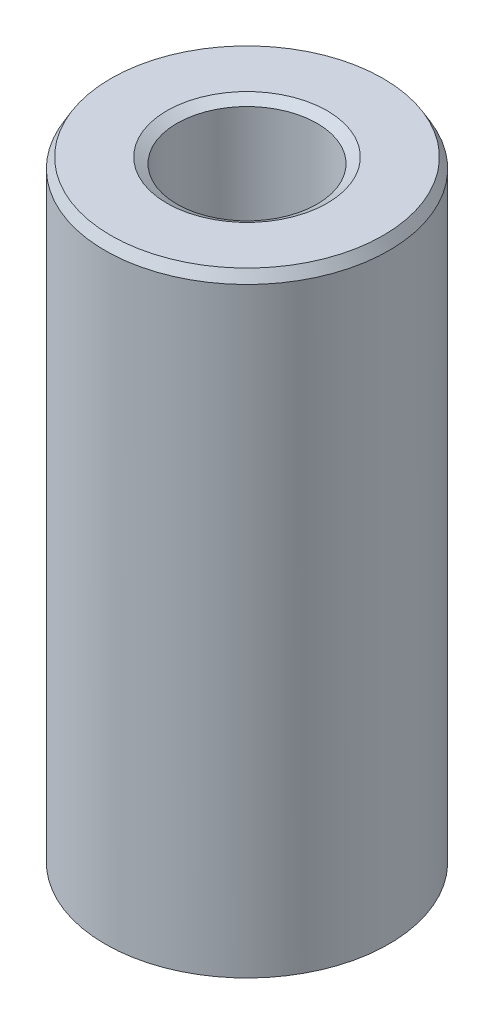
ISO-10303-21;
HEADER;
FILE_DESCRIPTION(('STEP AP214'),'2;1');
FILE_NAME('part.step','',(''),(''),'','','');
FILE_SCHEMA(('AUTOMOTIVE_DESIGN { 1 0 10303 214 1 1 1 1 }'));
ENDSEC;
DATA;
#1=APPLICATION_CONTEXT('core data for automotive mechanical design processes');
#2=APPLICATION_PROTOCOL_DEFINITION('international standard','automotive_design',2000,#1);
#3=PRODUCT_CONTEXT('',#1,'mechanical');
#4=PRODUCT('Part','Part','',(#3));
#5=PRODUCT_RELATED_PRODUCT_CATEGORY('part','',(#4));
#6=PRODUCT_DEFINITION_FORMATION('','',#4);
#7=PRODUCT_DEFINITION_CONTEXT('part definition',#1,'design');
#8=PRODUCT_DEFINITION('design','',#6,#7);
#9=PRODUCT_DEFINITION_SHAPE('','',#8);
#10=(LENGTH_UNIT() NAMED_UNIT(*) SI_UNIT(.MILLI.,.METRE.));
#11=(NAMED_UNIT(*) PLANE_ANGLE_UNIT() SI_UNIT($,.RADIAN.));
#12=(NAMED_UNIT(*) SI_UNIT($,.STERADIAN.) SOLID_ANGLE_UNIT());
#13=UNCERTAINTY_MEASURE_WITH_UNIT(LENGTH_MEASURE(1.E-05),#10,'distance_accuracy_value','');
#14=(GEOMETRIC_REPRESENTATION_CONTEXT(3) GLOBAL_UNCERTAINTY_ASSIGNED_CONTEXT((#13)) GLOBAL_UNIT_ASSIGNED_CONTEXT((#10,
#11,#12)) REPRESENTATION_CONTEXT('',''));
#15=CARTESIAN_POINT('',(0.,0.,0.));
#16=DIRECTION('',(0.,0.,1.));
#17=DIRECTION('',(1.,0.,0.));
#18=AXIS2_PLACEMENT_3D('',#15,#16,#17);
#19=CARTESIAN_POINT('',(0.,21.723398923579,0.));
#20=DIRECTION('',(0.,-1.,0.));
#21=DIRECTION('',(0.,0.,-1.));
#22=AXIS2_PLACEMENT_3D('',#19,#20,#21);
#23=CYLINDRICAL_SURFACE('',#22,5.);
#24=CARTESIAN_POINT('',(0.,0.205610074727865,0.));
#25=DIRECTION('',(0.,1.,0.));
#26=DIRECTION('',(0.,0.,1.));
#27=AXIS2_PLACEMENT_3D('',#24,#25,#26);
#28=CIRCLE('',#27,5.);
#29=CARTESIAN_POINT('',(0.,0.205610074727865,-5.));
#30=VERTEX_POINT('',#29);
#31=EDGE_CURVE('E10',#30,#30,#28,.T.);
#32=CARTESIAN_POINT('',(0.,21.3672718276024,0.));
#33=DIRECTION('',(0.,1.,0.));
#34=DIRECTION('',(0.,0.,1.));
#35=AXIS2_PLACEMENT_3D('',#32,#33,#34);
#36=CIRCLE('',#35,5.);
#37=CARTESIAN_POINT('',(0.,21.3672718276024,-5.));
#38=VERTEX_POINT('',#37);
#39=EDGE_CURVE('E50',#38,#38,#36,.F.);
#40=CARTESIAN_POINT('',(0.,0.205610074727865,-5.));
#41=CARTESIAN_POINT('',(0.,0.426044051320308,-5.));
#42=CARTESIAN_POINT('',(0.,0.64647802791275,-5.));
#43=CARTESIAN_POINT('',(0.,1.08734598109763,-5.));
#44=CARTESIAN_POINT('',(0.,1.30777995769008,-5.));
#45=CARTESIAN_POINT('',(0.,1.74864791087496,-5.));
#46=CARTESIAN_POINT('',(0.,1.9690818874674,-5.));
#47=CARTESIAN_POINT('',(0.,2.40994984065229,-5.));
#48=CARTESIAN_POINT('',(0.,2.63038381724474,-5.));
#49=CARTESIAN_POINT('',(0.,3.07125177042962,-5.));
#50=CARTESIAN_POINT('',(0.,3.29168574702206,-5.));
#51=CARTESIAN_POINT('',(0.,3.73255370020695,-5.));
#52=CARTESIAN_POINT('',(0.,3.95298767679939,-5.));
#53=CARTESIAN_POINT('',(0.,4.39385562998428,-5.));
#54=CARTESIAN_POINT('',(0.,4.61428960657672,-5.));
#55=CARTESIAN_POINT('',(0.,5.05515755976161,-5.));
#56=CARTESIAN_POINT('',(0.,5.27559153635405,-5.));
#57=CARTESIAN_POINT('',(0.,5.71645948953894,-5.));
#58=CARTESIAN_POINT('',(0.,5.93689346613138,-5.));
#59=CARTESIAN_POINT('',(0.,6.37776141931626,-5.));
#60=CARTESIAN_POINT('',(0.,6.5981953959087,-5.));
#61=CARTESIAN_POINT('',(0.,7.03906334909359,-5.));
#62=CARTESIAN_POINT('',(0.,7.25949732568603,-5.));
#63=CARTESIAN_POINT('',(0.,7.70036527887092,-5.));
#64=CARTESIAN_POINT('',(0.,7.92079925546336,-5.));
#65=CARTESIAN_POINT('',(0.,8.36166720864824,-5.));
#66=CARTESIAN_POINT('',(0.,8.58210118524069,-5.));
#67=CARTESIAN_POINT('',(0.,9.02296913842557,-5.));
#68=CARTESIAN_POINT('',(0.,9.24340311501802,-5.));
#69=CARTESIAN_POINT('',(0.,9.6842710682029,-5.));
#70=CARTESIAN_POINT('',(0.,9.90470504479534,-5.));
#71=CARTESIAN_POINT('',(0.,10.3455729979802,-5.));
#72=CARTESIAN_POINT('',(0.,10.5660069745727,-5.));
#73=CARTESIAN_POINT('',(0.,11.0068749277576,-5.));
#74=CARTESIAN_POINT('',(0.,11.22730890435,-5.));
#75=CARTESIAN_POINT('',(0.,11.6681768575349,-5.));
#76=CARTESIAN_POINT('',(0.,11.8886108341273,-5.));
#77=CARTESIAN_POINT('',(0.,12.3294787873122,-5.));
#78=CARTESIAN_POINT('',(0.,12.5499127639047,-5.));
#79=CARTESIAN_POINT('',(0.,12.9907807170895,-5.));
#80=CARTESIAN_POINT('',(0.,13.211214693682,-5.));
#81=CARTESIAN_POINT('',(0.,13.6520826468669,-5.));
#82=CARTESIAN_POINT('',(0.,13.8725166234593,-5.));
#83=CARTESIAN_POINT('',(0.,14.3133845766442,-5.));
#84=CARTESIAN_POINT('',(0.,14.5338185532366,-5.));
#85=CARTESIAN_POINT('',(0.,14.9746865064215,-5.));
#86=CARTESIAN_POINT('',(0.,15.195120483014,-5.));
#87=CARTESIAN_POINT('',(0.,15.6359884361989,-5.));
#88=CARTESIAN_POINT('',(0.,15.8564224127913,-5.));
#89=CARTESIAN_POINT('',(0.,16.2972903659762,-5.));
#90=CARTESIAN_POINT('',(0.,16.5177243425686,-5.));
#91=CARTESIAN_POINT('',(0.,16.9585922957535,-5.));
#92=CARTESIAN_POINT('',(0.,17.179026272346,-5.));
#93=CARTESIAN_POINT('',(0.,17.6198942255308,-5.));
#94=CARTESIAN_POINT('',(0.,17.8403282021233,-5.));
#95=CARTESIAN_POINT('',(0.,18.2811961553082,-5.));
#96=CARTESIAN_POINT('',(0.,18.5016301319006,-5.));
#97=CARTESIAN_POINT('',(0.,18.9424980850855,-5.));
#98=CARTESIAN_POINT('',(0.,19.1629320616779,-5.));
#99=CARTESIAN_POINT('',(0.,19.6038000148628,-5.));
#100=CARTESIAN_POINT('',(0.,19.8242339914553,-5.));
#101=CARTESIAN_POINT('',(0.,20.2651019446402,-5.));
#102=CARTESIAN_POINT('',(0.,20.4855359212326,-5.));
#103=CARTESIAN_POINT('',(0.,20.9264038744175,-5.));
#104=CARTESIAN_POINT('',(0.,21.1468378510099,-5.));
#105=CARTESIAN_POINT('',(0.,21.3672718276024,-5.));
#106=B_SPLINE_CURVE_WITH_KNOTS('',3,(#40,#41,#42,#43,#44,#45,#46,#47,#48,#49,#50,#51,#52,#53,
#54,#55,#56,#57,#58,#59,#60,#61,#62,#63,#64,#65,#66,#67,#68,#69,#70,#71,#72,#73,#74,#75,#76,#77,
#78,#79,#80,#81,#82,#83,#84,#85,#86,#87,#88,#89,#90,#91,#92,#93,#94,#95,#96,#97,#98,#99,#100,
#101,#102,#103,#104,#105),.UNSPECIFIED.,.F.,.F.,(4,2,2,2,2,2,2,2,2,2,2,2,2,2,2,2,2,2,2,2,2,2,2,
2,2,2,2,2,2,2,2,2,4),(0.,0.661301929777328,1.32260385955466,1.98390578933198,2.64520771910931,
3.30650964888664,3.96781157866397,4.6291135084413,5.29041543821863,5.95171736799595,
6.61301929777328,7.27432122755061,7.93562315732794,8.59692508710527,9.25822701688259,
9.91952894665992,10.5808308764373,11.2421328062146,11.9034347359919,12.5647366657692,
13.2260385955466,13.8873405253239,14.5486424551012,15.2099443848785,15.8712463146559,
16.5325482444332,17.1938501742105,17.8551521039879,18.5164540337652,19.1777559635425,
19.8390578933198,20.5003598230972,21.1616617528745),.UNSPECIFIED.);
#107=EDGE_CURVE('BSEAM39',#30,#38,#106,.T.);
#108=ORIENTED_EDGE('',*,*,#31,.T.);
#109=ORIENTED_EDGE('',*,*,#39,.T.);
#110=ORIENTED_EDGE('',*,*,#107,.T.);
#111=ORIENTED_EDGE('',*,*,#107,.F.);
#112=EDGE_LOOP('',(#108,#110,#109,#111));
#113=FACE_BOUND('',#112,.T.);
#114=ADVANCED_FACE('F39',(#113),#23,.T.);
#115=CARTESIAN_POINT('',(0.,21.723398923579,0.));
#116=DIRECTION('',(0.,1.,0.));
#117=DIRECTION('',(0.,0.,1.));
#118=AXIS2_PLACEMENT_3D('',#115,#116,#117);
#119=PLANE('',#118);
#120=CARTESIAN_POINT('',(0.,21.723398923579,0.));
#121=DIRECTION('',(0.,1.,0.));
#122=DIRECTION('',(0.,0.,1.));
#123=AXIS2_PLACEMENT_3D('',#120,#121,#122);
#124=CIRCLE('',#123,2.82465072930494);
#125=CARTESIAN_POINT('',(0.,21.723398923579,2.82465072930494));
#126=VERTEX_POINT('',#125);
#127=EDGE_CURVE('E58',#126,#126,#124,.F.);
#128=ORIENTED_EDGE('',*,*,#127,.T.);
#129=EDGE_LOOP('',(#128));
#130=FACE_BOUND('',#129,.T.);
#131=CARTESIAN_POINT('',(0.,21.723398923579,0.));
#132=DIRECTION('',(0.,1.,0.));
#133=DIRECTION('',(0.,0.,1.));
#134=AXIS2_PLACEMENT_3D('',#131,#132,#133);
#135=CIRCLE('',#134,4.79438992527216);
#136=CARTESIAN_POINT('',(0.,21.723398923579,-4.79438992527216));
#137=VERTEX_POINT('',#136);
#138=EDGE_CURVE('E61',#137,#137,#135,.T.);
#139=ORIENTED_EDGE('',*,*,#138,.T.);
#140=EDGE_LOOP('',(#139));
#141=FACE_BOUND('',#140,.T.);
#142=ADVANCED_FACE('F88',(#130,#141),#119,.T.);
#143=CARTESIAN_POINT('',(0.,0.,0.));
#144=DIRECTION('',(0.,1.,0.));
#145=DIRECTION('',(0.,0.,1.));
#146=AXIS2_PLACEMENT_3D('',#143,#144,#145);
#147=PLANE('',#146);
#148=CARTESIAN_POINT('',(0.,0.,0.));
#149=DIRECTION('',(0.,1.,0.));
#150=DIRECTION('',(0.,0.,1.));
#151=AXIS2_PLACEMENT_3D('',#148,#149,#150);
#152=CIRCLE('',#151,2.6741337080561);
#153=CARTESIAN_POINT('',(0.,0.,2.6741337080561));
#154=VERTEX_POINT('',#153);
#155=EDGE_CURVE('E51',#154,#154,#152,.T.);
#156=ORIENTED_EDGE('',*,*,#155,.T.);
#157=EDGE_LOOP('',(#156));
#158=FACE_BOUND('',#157,.T.);
#159=CARTESIAN_POINT('',(0.,0.,0.));
#160=DIRECTION('',(0.,1.,0.));
#161=DIRECTION('',(0.,0.,1.));
#162=AXIS2_PLACEMENT_3D('',#159,#160,#161);
#163=CIRCLE('',#162,4.6438729040233);
#164=CARTESIAN_POINT('',(0.,0.,4.6438729040233));
#165=VERTEX_POINT('',#164);
#166=EDGE_CURVE('E54',#165,#165,#163,.F.);
#167=ORIENTED_EDGE('',*,*,#166,.T.);
#168=EDGE_LOOP('',(#167));
#169=FACE_BOUND('',#168,.T.);
#170=ADVANCED_FACE('F83',(#158,#169),#147,.F.);
#171=CARTESIAN_POINT('',(0.,21.723398923579,0.));
#172=DIRECTION('',(0.,-1.,0.));
#173=DIRECTION('',(0.,0.,-1.));
#174=AXIS2_PLACEMENT_3D('',#171,#172,#173);
#175=CYLINDRICAL_SURFACE('',#174,2.46852363332824);
#176=CARTESIAN_POINT('',(0.,21.5177888488512,0.));
#177=DIRECTION('',(0.,1.,0.));
#178=DIRECTION('',(0.,0.,1.));
#179=AXIS2_PLACEMENT_3D('',#176,#177,#178);
#180=CIRCLE('',#179,2.46852363332824);
#181=CARTESIAN_POINT('',(0.,21.5177888488512,-2.46852363332824));
#182=VERTEX_POINT('',#181);
#183=EDGE_CURVE('E67',#182,#182,#180,.T.);
#184=CARTESIAN_POINT('',(0.,0.356127095976686,0.));
#185=DIRECTION('',(0.,1.,0.));
#186=DIRECTION('',(0.,0.,1.));
#187=AXIS2_PLACEMENT_3D('',#184,#185,#186);
#188=CIRCLE('',#187,2.46852363332824);
#189=CARTESIAN_POINT('',(0.,0.356127095976683,-2.46852363332824));
#190=VERTEX_POINT('',#189);
#191=EDGE_CURVE('E69',#190,#190,#188,.F.);
#192=CARTESIAN_POINT('',(0.,21.5177888488512,-2.46852363332824));
#193=CARTESIAN_POINT('',(0.,21.2973548722587,-2.46852363332824));
#194=CARTESIAN_POINT('',(0.,21.0769208956663,-2.46852363332824));
#195=CARTESIAN_POINT('',(0.,20.6360529424814,-2.46852363332824));
#196=CARTESIAN_POINT('',(0.,20.4156189658889,-2.46852363332824));
#197=CARTESIAN_POINT('',(0.,19.9747510127041,-2.46852363332824));
#198=CARTESIAN_POINT('',(0.,19.7543170361116,-2.46852363332824));
#199=CARTESIAN_POINT('',(0.,19.3134490829267,-2.46852363332824));
#200=CARTESIAN_POINT('',(0.,19.0930151063343,-2.46852363332824));
#201=CARTESIAN_POINT('',(0.,18.6521471531494,-2.46852363332824));
#202=CARTESIAN_POINT('',(0.,18.431713176557,-2.46852363332824));
#203=CARTESIAN_POINT('',(0.,17.9908452233721,-2.46852363332824));
#204=CARTESIAN_POINT('',(0.,17.7704112467796,-2.46852363332824));
#205=CARTESIAN_POINT('',(0.,17.3295432935948,-2.46852363332824));
#206=CARTESIAN_POINT('',(0.,17.1091093170023,-2.46852363332824));
#207=CARTESIAN_POINT('',(0.,16.6682413638174,-2.46852363332824));
#208=CARTESIAN_POINT('',(0.,16.447807387225,-2.46852363332824));
#209=CARTESIAN_POINT('',(0.,16.0069394340401,-2.46852363332824));
#210=CARTESIAN_POINT('',(0.,15.7865054574477,-2.46852363332824));
#211=CARTESIAN_POINT('',(0.,15.3456375042628,-2.46852363332824));
#212=CARTESIAN_POINT('',(0.,15.1252035276703,-2.46852363332824));
#213=CARTESIAN_POINT('',(0.,14.6843355744854,-2.46852363332824));
#214=CARTESIAN_POINT('',(0.,14.463901597893,-2.46852363332824));
#215=CARTESIAN_POINT('',(0.,14.0230336447081,-2.46852363332824));
#216=CARTESIAN_POINT('',(0.,13.8025996681157,-2.46852363332824));
#217=CARTESIAN_POINT('',(0.,13.3617317149308,-2.46852363332824));
#218=CARTESIAN_POINT('',(0.,13.1412977383383,-2.46852363332824));
#219=CARTESIAN_POINT('',(0.,12.7004297851535,-2.46852363332824));
#220=CARTESIAN_POINT('',(0.,12.479995808561,-2.46852363332824));
#221=CARTESIAN_POINT('',(0.,12.0391278553761,-2.46852363332824));
#222=CARTESIAN_POINT('',(0.,11.8186938787837,-2.46852363332824));
#223=CARTESIAN_POINT('',(0.,11.3778259255988,-2.46852363332824));
#224=CARTESIAN_POINT('',(0.,11.1573919490064,-2.46852363332824));
#225=CARTESIAN_POINT('',(0.,10.7165239958215,-2.46852363332824));
#226=CARTESIAN_POINT('',(0.,10.496090019229,-2.46852363332824));
#227=CARTESIAN_POINT('',(0.,10.0552220660442,-2.46852363332824));
#228=CARTESIAN_POINT('',(0.,9.83478808945171,-2.46852363332824));
#229=CARTESIAN_POINT('',(0.,9.39392013626682,-2.46852363332824));
#230=CARTESIAN_POINT('',(0.,9.17348615967438,-2.46852363332824));
#231=CARTESIAN_POINT('',(0.,8.73261820648949,-2.46852363332824));
#232=CARTESIAN_POINT('',(0.,8.51218422989705,-2.46852363332824));
#233=CARTESIAN_POINT('',(0.,8.07131627671217,-2.46852363332824));
#234=CARTESIAN_POINT('',(0.,7.85088230011973,-2.46852363332824));
#235=CARTESIAN_POINT('',(0.,7.41001434693484,-2.46852363332824));
#236=CARTESIAN_POINT('',(0.,7.1895803703424,-2.46852363332824));
#237=CARTESIAN_POINT('',(0.,6.74871241715752,-2.46852363332824));
#238=CARTESIAN_POINT('',(0.,6.52827844056507,-2.46852363332824));
#239=CARTESIAN_POINT('',(0.,6.08741048738019,-2.46852363332824));
#240=CARTESIAN_POINT('',(0.,5.86697651078775,-2.46852363332824));
#241=CARTESIAN_POINT('',(0.,5.42610855760286,-2.46852363332824));
#242=CARTESIAN_POINT('',(0.,5.20567458101042,-2.46852363332824));
#243=CARTESIAN_POINT('',(0.,4.76480662782553,-2.46852363332824));
#244=CARTESIAN_POINT('',(0.,4.54437265123309,-2.46852363332824));
#245=CARTESIAN_POINT('',(0.,4.10350469804821,-2.46852363332824));
#246=CARTESIAN_POINT('',(0.,3.88307072145576,-2.46852363332824));
#247=CARTESIAN_POINT('',(0.,3.44220276827088,-2.46852363332824));
#248=CARTESIAN_POINT('',(0.,3.22176879167844,-2.46852363332824));
#249=CARTESIAN_POINT('',(0.,2.78090083849355,-2.46852363332824));
#250=CARTESIAN_POINT('',(0.,2.56046686190111,-2.46852363332824));
#251=CARTESIAN_POINT('',(0.,2.11959890871622,-2.46852363332824));
#252=CARTESIAN_POINT('',(0.,1.89916493212378,-2.46852363332824));
#253=CARTESIAN_POINT('',(0.,1.4582969789389,-2.46852363332824));
#254=CARTESIAN_POINT('',(0.,1.23786300234645,-2.46852363332824));
#255=CARTESIAN_POINT('',(0.,0.796995049161568,-2.46852363332824));
#256=CARTESIAN_POINT('',(0.,0.576561072569125,-2.46852363332824));
#257=CARTESIAN_POINT('',(0.,0.356127095976683,-2.46852363332824));
#258=B_SPLINE_CURVE_WITH_KNOTS('',3,(#192,#193,#194,#195,#196,#197,#198,#199,#200,#201,#202,
#203,#204,#205,#206,#207,#208,#209,#210,#211,#212,#213,#214,#215,#216,#217,#218,#219,#220,#221,
#222,#223,#224,#225,#226,#227,#228,#229,#230,#231,#232,#233,#234,#235,#236,#237,#238,#239,#240,
#241,#242,#243,#244,#245,#246,#247,#248,#249,#250,#251,#252,#253,#254,#255,#256,#257),
.UNSPECIFIED.,.F.,.F.,(4,2,2,2,2,2,2,2,2,2,2,2,2,2,2,2,2,2,2,2,2,2,2,2,2,2,2,2,2,2,2,2,4),(0.,
0.661301929777324,1.32260385955465,1.98390578933198,2.64520771910931,3.30650964888663,
3.96781157866396,4.62911350844129,5.29041543821862,5.95171736799595,6.61301929777327,
7.2743212275506,7.93562315732792,8.59692508710525,9.25822701688258,9.91952894665991,
10.5808308764372,11.2421328062146,11.9034347359919,12.5647366657692,13.2260385955465,
13.8873405253239,14.5486424551012,15.2099443848785,15.8712463146559,16.5325482444332,
17.1938501742105,17.8551521039878,18.5164540337652,19.1777559635425,19.8390578933198,
20.5003598230971,21.1616617528745),.UNSPECIFIED.);
#259=EDGE_CURVE('BSEAM71',#182,#190,#258,.T.);
#260=ORIENTED_EDGE('',*,*,#183,.T.);
#261=ORIENTED_EDGE('',*,*,#191,.T.);
#262=ORIENTED_EDGE('',*,*,#259,.T.);
#263=ORIENTED_EDGE('',*,*,#259,.F.);
#264=EDGE_LOOP('',(#260,#262,#261,#263));
#265=FACE_BOUND('',#264,.T.);
#266=ADVANCED_FACE('F71',(#265),#175,.F.);
#267=CARTESIAN_POINT('',(0.,21.5177888488512,0.));
#268=DIRECTION('',(0.,1.,0.));
#269=DIRECTION('',(0.,0.,1.));
#270=AXIS2_PLACEMENT_3D('',#267,#268,#269);
#271=CONICAL_SURFACE('',#270,2.46852363332824,1.0471975511966);
#272=ORIENTED_EDGE('',*,*,#127,.F.);
#273=EDGE_LOOP('',(#272));
#274=FACE_BOUND('',#273,.T.);
#275=ORIENTED_EDGE('',*,*,#183,.F.);
#276=EDGE_LOOP('',(#275));
#277=FACE_BOUND('',#276,.T.);
#278=ADVANCED_FACE('F77',(#274,#277),#271,.F.);
#279=CARTESIAN_POINT('',(0.,0.,0.));
#280=DIRECTION('',(0.,-1.,0.));
#281=DIRECTION('',(0.,0.,-1.));
#282=AXIS2_PLACEMENT_3D('',#279,#280,#281);
#283=CONICAL_SURFACE('',#282,2.6741337080561,0.523598775598293);
#284=ORIENTED_EDGE('',*,*,#191,.F.);
#285=EDGE_LOOP('',(#284));
#286=FACE_BOUND('',#285,.T.);
#287=ORIENTED_EDGE('',*,*,#155,.F.);
#288=EDGE_LOOP('',(#287));
#289=FACE_BOUND('',#288,.T.);
#290=ADVANCED_FACE('F73',(#286,#289),#283,.F.);
#291=CARTESIAN_POINT('',(0.,0.205610074727865,0.));
#292=DIRECTION('',(0.,1.,0.));
#293=DIRECTION('',(0.,0.,1.));
#294=AXIS2_PLACEMENT_3D('',#291,#292,#293);
#295=CONICAL_SURFACE('',#294,5.,1.0471975511966);
#296=ORIENTED_EDGE('',*,*,#166,.F.);
#297=EDGE_LOOP('',(#296));
#298=FACE_BOUND('',#297,.T.);
#299=ORIENTED_EDGE('',*,*,#31,.F.);
#300=EDGE_LOOP('',(#299));
#301=FACE_BOUND('',#300,.T.);
#302=ADVANCED_FACE('F76',(#298,#301),#295,.T.);
#303=CARTESIAN_POINT('',(0.,21.723398923579,0.));
#304=DIRECTION('',(0.,-1.,0.));
#305=DIRECTION('',(0.,0.,-1.));
#306=AXIS2_PLACEMENT_3D('',#303,#304,#305);
#307=CONICAL_SURFACE('',#306,4.79438992527216,0.523598775598292);
#308=CARTESIAN_POINT('',(0.,21.3672718276024,-5.));
#309=CARTESIAN_POINT('',(0.,21.3709814848521,-4.99785822838825));
#310=CARTESIAN_POINT('',(0.,21.3746911421019,-4.99571645677651));
#311=CARTESIAN_POINT('',(0.,21.3821104566014,-4.99143291355301));
#312=CARTESIAN_POINT('',(0.,21.3858201138512,-4.98929114194126));
#313=CARTESIAN_POINT('',(0.,21.3932394283507,-4.98500759871776));
#314=CARTESIAN_POINT('',(0.,21.3969490856004,-4.98286582710601));
#315=CARTESIAN_POINT('',(0.,21.4043684000999,-4.97858228388252));
#316=CARTESIAN_POINT('',(0.,21.4080780573497,-4.97644051227077));
#317=CARTESIAN_POINT('',(0.,21.4154973718492,-4.97215696904727));
#318=CARTESIAN_POINT('',(0.,21.419207029099,-4.97001519743552));
#319=CARTESIAN_POINT('',(0.,21.4266263435985,-4.96573165421203));
#320=CARTESIAN_POINT('',(0.,21.4303360008482,-4.96358988260028));
#321=CARTESIAN_POINT('',(0.,21.4377553153477,-4.95930633937678));
#322=CARTESIAN_POINT('',(0.,21.4414649725975,-4.95716456776503));
#323=CARTESIAN_POINT('',(0.,21.448884287097,-4.95288102454154));
#324=CARTESIAN_POINT('',(0.,21.4525939443468,-4.95073925292979));
#325=CARTESIAN_POINT('',(0.,21.4600132588463,-4.94645570970629));
#326=CARTESIAN_POINT('',(0.,21.463722916096,-4.94431393809454));
#327=CARTESIAN_POINT('',(0.,21.4711422305956,-4.94003039487105));
#328=CARTESIAN_POINT('',(0.,21.4748518878453,-4.9378886232593));
#329=CARTESIAN_POINT('',(0.,21.4822712023448,-4.9336050800358));
#330=CARTESIAN_POINT('',(0.,21.4859808595946,-4.93146330842405));
#331=CARTESIAN_POINT('',(0.,21.4934001740941,-4.92717976520056));
#332=CARTESIAN_POINT('',(0.,21.4971098313439,-4.92503799358881));
#333=CARTESIAN_POINT('',(0.,21.5045291458434,-4.92075445036531));
#334=CARTESIAN_POINT('',(0.,21.5082388030931,-4.91861267875356));
#335=CARTESIAN_POINT('',(0.,21.5156581175926,-4.91432913553007));
#336=CARTESIAN_POINT('',(0.,21.5193677748424,-4.91218736391832));
#337=CARTESIAN_POINT('',(0.,21.5267870893419,-4.90790382069482));
#338=CARTESIAN_POINT('',(0.,21.5304967465917,-4.90576204908307));
#339=CARTESIAN_POINT('',(0.,21.5379160610912,-4.90147850585958));
#340=CARTESIAN_POINT('',(0.,21.5416257183409,-4.89933673424783));
#341=CARTESIAN_POINT('',(0.,21.5490450328405,-4.89505319102433));
#342=CARTESIAN_POINT('',(0.,21.5527546900902,-4.89291141941258));
#343=CARTESIAN_POINT('',(0.,21.5601740045897,-4.88862787618909));
#344=CARTESIAN_POINT('',(0.,21.5638836618395,-4.88648610457734));
#345=CARTESIAN_POINT('',(0.,21.571302976339,-4.88220256135384));
#346=CARTESIAN_POINT('',(0.,21.5750126335888,-4.88006078974209));
#347=CARTESIAN_POINT('',(0.,21.5824319480883,-4.8757772465186));
#348=CARTESIAN_POINT('',(0.,21.586141605338,-4.87363547490685));
#349=CARTESIAN_POINT('',(0.,21.5935609198375,-4.86935193168335));
#350=CARTESIAN_POINT('',(0.,21.5972705770873,-4.8672101600716));
#351=CARTESIAN_POINT('',(0.,21.6046898915868,-4.86292661684811));
#352=CARTESIAN_POINT('',(0.,21.6083995488366,-4.86078484523636));
#353=CARTESIAN_POINT('',(0.,21.6158188633361,-4.85650130201286));
#354=CARTESIAN_POINT('',(0.,21.6195285205858,-4.85435953040111));
#355=CARTESIAN_POINT('',(0.,21.6269478350853,-4.85007598717762));
#356=CARTESIAN_POINT('',(0.,21.6306574923351,-4.84793421556587));
#357=CARTESIAN_POINT('',(0.,21.6380768068346,-4.84365067234237));
#358=CARTESIAN_POINT('',(0.,21.6417864640844,-4.84150890073062));
#359=CARTESIAN_POINT('',(0.,21.6492057785839,-4.83722535750713));
#360=CARTESIAN_POINT('',(0.,21.6529154358336,-4.83508358589538));
#361=CARTESIAN_POINT('',(0.,21.6603347503332,-4.83080004267188));
#362=CARTESIAN_POINT('',(0.,21.6640444075829,-4.82865827106013));
#363=CARTESIAN_POINT('',(0.,21.6714637220824,-4.82437472783664));
#364=CARTESIAN_POINT('',(0.,21.6751733793322,-4.82223295622489));
#365=CARTESIAN_POINT('',(0.,21.6825926938317,-4.81794941300139));
#366=CARTESIAN_POINT('',(0.,21.6863023510815,-4.81580764138964));
#367=CARTESIAN_POINT('',(0.,21.693721665581,-4.81152409816615));
#368=CARTESIAN_POINT('',(0.,21.6974313228307,-4.8093823265544));
#369=CARTESIAN_POINT('',(0.,21.7048506373302,-4.8050987833309));
#370=CARTESIAN_POINT('',(0.,21.70856029458,-4.80295701171915));
#371=CARTESIAN_POINT('',(0.,21.7159796090795,-4.79867346849566));
#372=CARTESIAN_POINT('',(0.,21.7196892663293,-4.79653169688391));
#373=CARTESIAN_POINT('',(0.,21.723398923579,-4.79438992527216));
#374=B_SPLINE_CURVE_WITH_KNOTS('',3,(#308,#309,#310,#311,#312,#313,#314,#315,#316,#317,#318,
#319,#320,#321,#322,#323,#324,#325,#326,#327,#328,#329,#330,#331,#332,#333,#334,#335,#336,#337,
#338,#339,#340,#341,#342,#343,#344,#345,#346,#347,#348,#349,#350,#351,#352,#353,#354,#355,#356,
#357,#358,#359,#360,#361,#362,#363,#364,#365,#366,#367,#368,#369,#370,#371,#372,#373),
.UNSPECIFIED.,.F.,.F.,(4,2,2,2,2,2,2,2,2,2,2,2,2,2,2,2,2,2,2,2,2,2,2,2,2,2,2,2,2,2,2,2,4),(0.,
0.0128506296704929,0.0257012593409833,0.0385518890114732,0.0514025186819631,0.0642531483524534,
0.0771037780229433,0.0899544076934332,0.102805037363924,0.115655667034413,0.128506296704904,
0.141356926375394,0.154207556045884,0.167058185716374,0.179908815386864,0.192759445057354,
0.205610074727844,0.218460704398334,0.231311334068824,0.244161963739314,0.257012593409804,
0.269863223080295,0.282713852750785,0.295564482421274,0.308415112091765,0.321265741762255,
0.334116371432745,0.346967001103235,0.359817630773725,0.372668260444215,0.385518890114705,
0.398369519785195,0.411220149455688),.UNSPECIFIED.);
#375=EDGE_CURVE('BSEAM45',#38,#137,#374,.T.);
#376=ORIENTED_EDGE('',*,*,#39,.F.);
#377=ORIENTED_EDGE('',*,*,#138,.F.);
#378=ORIENTED_EDGE('',*,*,#375,.T.);
#379=ORIENTED_EDGE('',*,*,#375,.F.);
#380=EDGE_LOOP('',(#376,#378,#377,#379));
#381=FACE_BOUND('',#380,.T.);
#382=ADVANCED_FACE('F45',(#381),#307,.T.);
#383=CLOSED_SHELL('',(#114,#142,#170,#266,#278,#290,#302,#382));
#384=MANIFOLD_SOLID_BREP('B2',#383);
#385=ADVANCED_BREP_SHAPE_REPRESENTATION('',(#18,#384),#14);
#386=SHAPE_DEFINITION_REPRESENTATION(#9,#385);
ENDSEC;
END-ISO-10303-21;
